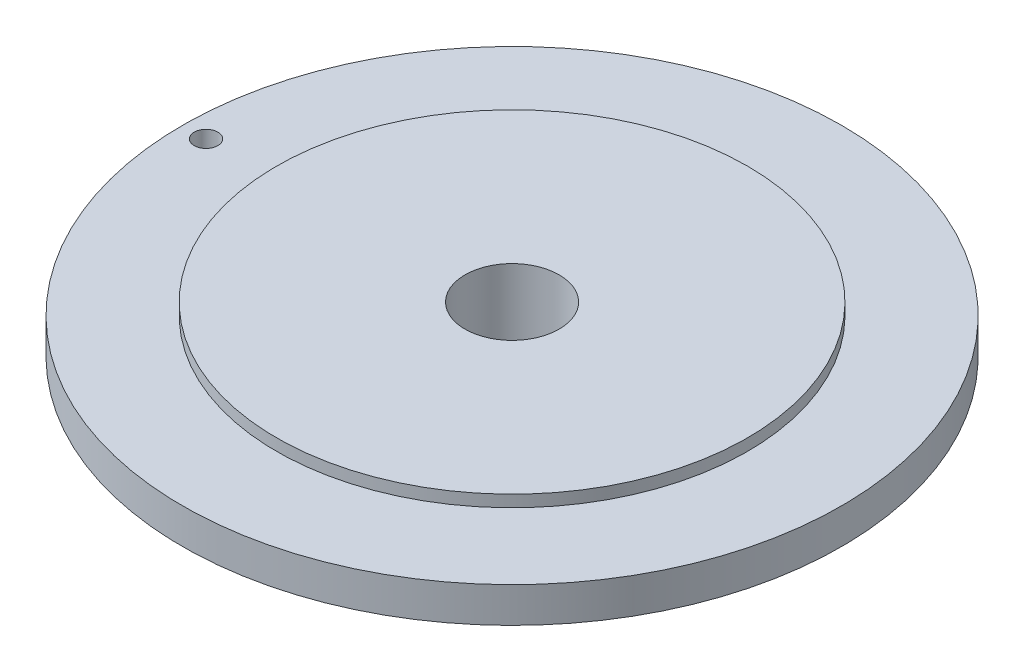
ISO-10303-21;
HEADER;
FILE_DESCRIPTION(('STEP AP214'),'2;1');
FILE_NAME('part.step','',(''),(''),'','','');
FILE_SCHEMA(('AUTOMOTIVE_DESIGN { 1 0 10303 214 1 1 1 1 }'));
ENDSEC;
DATA;
#1=APPLICATION_CONTEXT('core data for automotive mechanical design processes');
#2=APPLICATION_PROTOCOL_DEFINITION('international standard','automotive_design',2000,#1);
#3=PRODUCT_CONTEXT('',#1,'mechanical');
#4=PRODUCT('Part','Part','',(#3));
#5=PRODUCT_RELATED_PRODUCT_CATEGORY('part','',(#4));
#6=PRODUCT_DEFINITION_FORMATION('','',#4);
#7=PRODUCT_DEFINITION_CONTEXT('part definition',#1,'design');
#8=PRODUCT_DEFINITION('design','',#6,#7);
#9=PRODUCT_DEFINITION_SHAPE('','',#8);
#10=(LENGTH_UNIT() NAMED_UNIT(*) SI_UNIT(.MILLI.,.METRE.));
#11=(NAMED_UNIT(*) PLANE_ANGLE_UNIT() SI_UNIT($,.RADIAN.));
#12=(NAMED_UNIT(*) SI_UNIT($,.STERADIAN.) SOLID_ANGLE_UNIT());
#13=UNCERTAINTY_MEASURE_WITH_UNIT(LENGTH_MEASURE(1.E-05),#10,'distance_accuracy_value','');
#14=(GEOMETRIC_REPRESENTATION_CONTEXT(3) GLOBAL_UNCERTAINTY_ASSIGNED_CONTEXT((#13)) GLOBAL_UNIT_ASSIGNED_CONTEXT((#10,
#11,#12)) REPRESENTATION_CONTEXT('',''));
#15=CARTESIAN_POINT('',(0.,0.,0.));
#16=DIRECTION('',(0.,0.,1.));
#17=DIRECTION('',(1.,0.,0.));
#18=AXIS2_PLACEMENT_3D('',#15,#16,#17);
#19=CARTESIAN_POINT('',(-7.9375,0.,0.));
#20=DIRECTION('',(0.,1.,0.));
#21=DIRECTION('',(0.,0.,1.));
#22=AXIS2_PLACEMENT_3D('',#19,#20,#21);
#23=PLANE('',#22);
#24=CARTESIAN_POINT('',(0.,0.,0.));
#25=DIRECTION('',(0.,-1.,0.));
#26=DIRECTION('',(0.,0.,-1.));
#27=AXIS2_PLACEMENT_3D('',#24,#25,#26);
#28=CIRCLE('',#27,6.35);
#29=CARTESIAN_POINT('',(0.,0.,-6.35));
#30=VERTEX_POINT('',#29);
#31=EDGE_CURVE('E10',#30,#30,#28,.T.);
#32=ORIENTED_EDGE('',*,*,#31,.F.);
#33=EDGE_LOOP('',(#32));
#34=FACE_BOUND('',#33,.T.);
#35=CARTESIAN_POINT('',(0.,0.,0.));
#36=DIRECTION('',(0.,-1.,0.));
#37=DIRECTION('',(0.,0.,-1.));
#38=AXIS2_PLACEMENT_3D('',#35,#36,#37);
#39=CIRCLE('',#38,7.9375);
#40=CARTESIAN_POINT('',(0.,0.,-7.9375));
#41=VERTEX_POINT('',#40);
#42=EDGE_CURVE('E88',#41,#41,#39,.T.);
#43=ORIENTED_EDGE('',*,*,#42,.T.);
#44=EDGE_LOOP('',(#43));
#45=FACE_BOUND('',#44,.T.);
#46=ADVANCED_FACE('F37',(#34,#45),#23,.F.);
#47=CARTESIAN_POINT('',(0.,0.,0.));
#48=DIRECTION('',(0.,-1.,0.));
#49=DIRECTION('',(0.,0.,-1.));
#50=AXIS2_PLACEMENT_3D('',#47,#48,#49);
#51=CYLINDRICAL_SURFACE('',#50,6.35);
#52=CARTESIAN_POINT('',(0.,19.05,0.));
#53=DIRECTION('',(0.,-1.,0.));
#54=DIRECTION('',(0.,0.,-1.));
#55=AXIS2_PLACEMENT_3D('',#52,#53,#54);
#56=CIRCLE('',#55,6.35);
#57=CARTESIAN_POINT('',(0.,19.05,-6.35));
#58=VERTEX_POINT('',#57);
#59=EDGE_CURVE('E44',#58,#58,#56,.T.);
#60=ORIENTED_EDGE('',*,*,#59,.F.);
#61=EDGE_LOOP('',(#60));
#62=FACE_BOUND('',#61,.T.);
#63=ORIENTED_EDGE('',*,*,#31,.T.);
#64=EDGE_LOOP('',(#63));
#65=FACE_BOUND('',#64,.T.);
#66=ADVANCED_FACE('F121',(#62,#65),#51,.F.);
#67=CARTESIAN_POINT('',(-6.35,19.05,0.));
#68=DIRECTION('',(0.,-1.,0.));
#69=DIRECTION('',(0.,0.,-1.));
#70=AXIS2_PLACEMENT_3D('',#67,#68,#69);
#71=PLANE('',#70);
#72=CARTESIAN_POINT('',(0.,19.05,0.));
#73=DIRECTION('',(0.,-1.,0.));
#74=DIRECTION('',(0.,0.,-1.));
#75=AXIS2_PLACEMENT_3D('',#72,#73,#74);
#76=CIRCLE('',#75,31.75);
#77=CARTESIAN_POINT('',(0.,19.05,-31.75));
#78=VERTEX_POINT('',#77);
#79=EDGE_CURVE('E49',#78,#78,#76,.T.);
#80=ORIENTED_EDGE('',*,*,#79,.F.);
#81=EDGE_LOOP('',(#80));
#82=FACE_BOUND('',#81,.T.);
#83=ORIENTED_EDGE('',*,*,#59,.T.);
#84=EDGE_LOOP('',(#83));
#85=FACE_BOUND('',#84,.T.);
#86=ADVANCED_FACE('F116',(#82,#85),#71,.F.);
#87=CARTESIAN_POINT('',(0.,0.,0.));
#88=DIRECTION('',(0.,-1.,0.));
#89=DIRECTION('',(0.,0.,-1.));
#90=AXIS2_PLACEMENT_3D('',#87,#88,#89);
#91=CYLINDRICAL_SURFACE('',#90,31.75);
#92=CARTESIAN_POINT('',(0.,17.4625,0.));
#93=DIRECTION('',(0.,-1.,0.));
#94=DIRECTION('',(0.,0.,-1.));
#95=AXIS2_PLACEMENT_3D('',#92,#93,#94);
#96=CIRCLE('',#95,31.75);
#97=CARTESIAN_POINT('',(0.,17.4625,-31.75));
#98=VERTEX_POINT('',#97);
#99=EDGE_CURVE('E54',#98,#98,#96,.T.);
#100=ORIENTED_EDGE('',*,*,#99,.F.);
#101=EDGE_LOOP('',(#100));
#102=FACE_BOUND('',#101,.T.);
#103=ORIENTED_EDGE('',*,*,#79,.T.);
#104=EDGE_LOOP('',(#103));
#105=FACE_BOUND('',#104,.T.);
#106=ADVANCED_FACE('F108',(#102,#105),#91,.T.);
#107=CARTESIAN_POINT('',(-31.75,17.4625,0.));
#108=DIRECTION('',(0.,-1.,0.));
#109=DIRECTION('',(0.,0.,-1.));
#110=AXIS2_PLACEMENT_3D('',#107,#108,#109);
#111=PLANE('',#110);
#112=CARTESIAN_POINT('',(-41.275,17.4625,0.));
#113=DIRECTION('',(0.,1.,0.));
#114=DIRECTION('',(0.,0.,1.));
#115=AXIS2_PLACEMENT_3D('',#112,#113,#114);
#116=CIRCLE('',#115,1.58749999999998);
#117=CARTESIAN_POINT('',(-41.275,17.4625,1.58749999999998));
#118=VERTEX_POINT('',#117);
#119=EDGE_CURVE('E96',#118,#118,#116,.T.);
#120=ORIENTED_EDGE('',*,*,#119,.F.);
#121=EDGE_LOOP('',(#120));
#122=FACE_BOUND('',#121,.T.);
#123=CARTESIAN_POINT('',(0.,17.4625,0.));
#124=DIRECTION('',(0.,-1.,0.));
#125=DIRECTION('',(0.,0.,-1.));
#126=AXIS2_PLACEMENT_3D('',#123,#124,#125);
#127=CIRCLE('',#126,44.45);
#128=CARTESIAN_POINT('',(0.,17.4625,-44.45));
#129=VERTEX_POINT('',#128);
#130=EDGE_CURVE('E60',#129,#129,#127,.T.);
#131=ORIENTED_EDGE('',*,*,#130,.F.);
#132=EDGE_LOOP('',(#131));
#133=FACE_BOUND('',#132,.T.);
#134=ORIENTED_EDGE('',*,*,#99,.T.);
#135=EDGE_LOOP('',(#134));
#136=FACE_BOUND('',#135,.T.);
#137=ADVANCED_FACE('F104',(#122,#133,#136),#111,.F.);
#138=CARTESIAN_POINT('',(0.,0.,0.));
#139=DIRECTION('',(0.,-1.,0.));
#140=DIRECTION('',(0.,0.,-1.));
#141=AXIS2_PLACEMENT_3D('',#138,#139,#140);
#142=CYLINDRICAL_SURFACE('',#141,44.45);
#143=CARTESIAN_POINT('',(0.,12.7,0.));
#144=DIRECTION('',(0.,-1.,0.));
#145=DIRECTION('',(0.,0.,-1.));
#146=AXIS2_PLACEMENT_3D('',#143,#144,#145);
#147=CIRCLE('',#146,44.45);
#148=CARTESIAN_POINT('',(0.,12.7,-44.45));
#149=VERTEX_POINT('',#148);
#150=EDGE_CURVE('E64',#149,#149,#147,.T.);
#151=ORIENTED_EDGE('',*,*,#150,.F.);
#152=EDGE_LOOP('',(#151));
#153=FACE_BOUND('',#152,.T.);
#154=ORIENTED_EDGE('',*,*,#130,.T.);
#155=EDGE_LOOP('',(#154));
#156=FACE_BOUND('',#155,.T.);
#157=ADVANCED_FACE('F107',(#153,#156),#142,.T.);
#158=CARTESIAN_POINT('',(-44.45,12.7,0.));
#159=DIRECTION('',(0.,1.,0.));
#160=DIRECTION('',(0.,0.,1.));
#161=AXIS2_PLACEMENT_3D('',#158,#159,#160);
#162=PLANE('',#161);
#163=CARTESIAN_POINT('',(-41.275,12.7,0.));
#164=DIRECTION('',(0.,1.,0.));
#165=DIRECTION('',(0.,0.,1.));
#166=AXIS2_PLACEMENT_3D('',#163,#164,#165);
#167=CIRCLE('',#166,1.58749999999999);
#168=CARTESIAN_POINT('',(-41.275,12.7,1.58749999999999));
#169=VERTEX_POINT('',#168);
#170=EDGE_CURVE('E92',#169,#169,#167,.T.);
#171=ORIENTED_EDGE('',*,*,#170,.T.);
#172=EDGE_LOOP('',(#171));
#173=FACE_BOUND('',#172,.T.);
#174=CARTESIAN_POINT('',(0.,12.7,0.));
#175=DIRECTION('',(0.,-1.,0.));
#176=DIRECTION('',(0.,0.,-1.));
#177=AXIS2_PLACEMENT_3D('',#174,#175,#176);
#178=CIRCLE('',#177,12.7);
#179=CARTESIAN_POINT('',(0.,12.7,-12.7));
#180=VERTEX_POINT('',#179);
#181=EDGE_CURVE('E68',#180,#180,#178,.T.);
#182=ORIENTED_EDGE('',*,*,#181,.F.);
#183=EDGE_LOOP('',(#182));
#184=FACE_BOUND('',#183,.T.);
#185=ORIENTED_EDGE('',*,*,#150,.T.);
#186=EDGE_LOOP('',(#185));
#187=FACE_BOUND('',#186,.T.);
#188=ADVANCED_FACE('F161',(#173,#184,#187),#162,.F.);
#189=CARTESIAN_POINT('',(0.,0.,0.));
#190=DIRECTION('',(0.,-1.,0.));
#191=DIRECTION('',(0.,0.,-1.));
#192=AXIS2_PLACEMENT_3D('',#189,#190,#191);
#193=CYLINDRICAL_SURFACE('',#192,12.7);
#194=CARTESIAN_POINT('',(0.,0.,0.));
#195=DIRECTION('',(0.,-1.,0.));
#196=DIRECTION('',(0.,0.,-1.));
#197=AXIS2_PLACEMENT_3D('',#194,#195,#196);
#198=CIRCLE('',#197,12.7);
#199=CARTESIAN_POINT('',(0.,0.,-12.7));
#200=VERTEX_POINT('',#199);
#201=EDGE_CURVE('E72',#200,#200,#198,.T.);
#202=ORIENTED_EDGE('',*,*,#201,.F.);
#203=EDGE_LOOP('',(#202));
#204=FACE_BOUND('',#203,.T.);
#205=ORIENTED_EDGE('',*,*,#181,.T.);
#206=EDGE_LOOP('',(#205));
#207=FACE_BOUND('',#206,.T.);
#208=ADVANCED_FACE('F155',(#204,#207),#193,.T.);
#209=CARTESIAN_POINT('',(-10.9855,0.,0.));
#210=DIRECTION('',(0.,1.,0.));
#211=DIRECTION('',(0.,0.,1.));
#212=AXIS2_PLACEMENT_3D('',#209,#210,#211);
#213=PLANE('',#212);
#214=CARTESIAN_POINT('',(0.,0.,0.));
#215=DIRECTION('',(0.,-1.,0.));
#216=DIRECTION('',(0.,0.,-1.));
#217=AXIS2_PLACEMENT_3D('',#214,#215,#216);
#218=CIRCLE('',#217,10.9855);
#219=CARTESIAN_POINT('',(0.,0.,-10.9855));
#220=VERTEX_POINT('',#219);
#221=EDGE_CURVE('E76',#220,#220,#218,.T.);
#222=ORIENTED_EDGE('',*,*,#221,.F.);
#223=EDGE_LOOP('',(#222));
#224=FACE_BOUND('',#223,.T.);
#225=ORIENTED_EDGE('',*,*,#201,.T.);
#226=EDGE_LOOP('',(#225));
#227=FACE_BOUND('',#226,.T.);
#228=ADVANCED_FACE('F149',(#224,#227),#213,.F.);
#229=CARTESIAN_POINT('',(0.,0.,0.));
#230=DIRECTION('',(0.,-1.,0.));
#231=DIRECTION('',(0.,0.,-1.));
#232=AXIS2_PLACEMENT_3D('',#229,#230,#231);
#233=CYLINDRICAL_SURFACE('',#232,10.9855);
#234=CARTESIAN_POINT('',(0.,2.03199999999999,0.));
#235=DIRECTION('',(0.,-1.,0.));
#236=DIRECTION('',(0.,0.,-1.));
#237=AXIS2_PLACEMENT_3D('',#234,#235,#236);
#238=CIRCLE('',#237,10.9855);
#239=CARTESIAN_POINT('',(0.,2.03199999999999,-10.9855));
#240=VERTEX_POINT('',#239);
#241=EDGE_CURVE('E80',#240,#240,#238,.T.);
#242=ORIENTED_EDGE('',*,*,#241,.F.);
#243=EDGE_LOOP('',(#242));
#244=FACE_BOUND('',#243,.T.);
#245=ORIENTED_EDGE('',*,*,#221,.T.);
#246=EDGE_LOOP('',(#245));
#247=FACE_BOUND('',#246,.T.);
#248=ADVANCED_FACE('F143',(#244,#247),#233,.F.);
#249=CARTESIAN_POINT('',(-10.9855,2.03199999999999,0.));
#250=DIRECTION('',(0.,1.,0.));
#251=DIRECTION('',(0.,0.,1.));
#252=AXIS2_PLACEMENT_3D('',#249,#250,#251);
#253=PLANE('',#252);
#254=CARTESIAN_POINT('',(0.,2.03199999999999,0.));
#255=DIRECTION('',(0.,-1.,0.));
#256=DIRECTION('',(0.,0.,-1.));
#257=AXIS2_PLACEMENT_3D('',#254,#255,#256);
#258=CIRCLE('',#257,7.9375);
#259=CARTESIAN_POINT('',(0.,2.03199999999999,-7.9375));
#260=VERTEX_POINT('',#259);
#261=EDGE_CURVE('E84',#260,#260,#258,.T.);
#262=ORIENTED_EDGE('',*,*,#261,.F.);
#263=EDGE_LOOP('',(#262));
#264=FACE_BOUND('',#263,.T.);
#265=ORIENTED_EDGE('',*,*,#241,.T.);
#266=EDGE_LOOP('',(#265));
#267=FACE_BOUND('',#266,.T.);
#268=ADVANCED_FACE('F137',(#264,#267),#253,.F.);
#269=CARTESIAN_POINT('',(0.,0.,0.));
#270=DIRECTION('',(0.,-1.,0.));
#271=DIRECTION('',(0.,0.,-1.));
#272=AXIS2_PLACEMENT_3D('',#269,#270,#271);
#273=CYLINDRICAL_SURFACE('',#272,7.9375);
#274=ORIENTED_EDGE('',*,*,#42,.F.);
#275=EDGE_LOOP('',(#274));
#276=FACE_BOUND('',#275,.T.);
#277=ORIENTED_EDGE('',*,*,#261,.T.);
#278=EDGE_LOOP('',(#277));
#279=FACE_BOUND('',#278,.T.);
#280=ADVANCED_FACE('F134',(#276,#279),#273,.T.);
#281=CARTESIAN_POINT('',(-41.275,17.4625,0.));
#282=DIRECTION('',(0.,1.,0.));
#283=DIRECTION('',(0.,0.,1.));
#284=AXIS2_PLACEMENT_3D('',#281,#282,#283);
#285=CYLINDRICAL_SURFACE('',#284,1.58749999999999);
#286=ORIENTED_EDGE('',*,*,#119,.T.);
#287=EDGE_LOOP('',(#286));
#288=FACE_BOUND('',#287,.T.);
#289=ORIENTED_EDGE('',*,*,#170,.F.);
#290=EDGE_LOOP('',(#289));
#291=FACE_BOUND('',#290,.T.);
#292=ADVANCED_FACE('F101',(#288,#291),#285,.F.);
#293=CLOSED_SHELL('',(#46,#66,#86,#106,#137,#157,#188,#208,#228,#248,#268,#280,#292));
#294=MANIFOLD_SOLID_BREP('B2',#293);
#295=ADVANCED_BREP_SHAPE_REPRESENTATION('',(#18,#294),#14);
#296=SHAPE_DEFINITION_REPRESENTATION(#9,#295);
ENDSEC;
END-ISO-10303-21;
